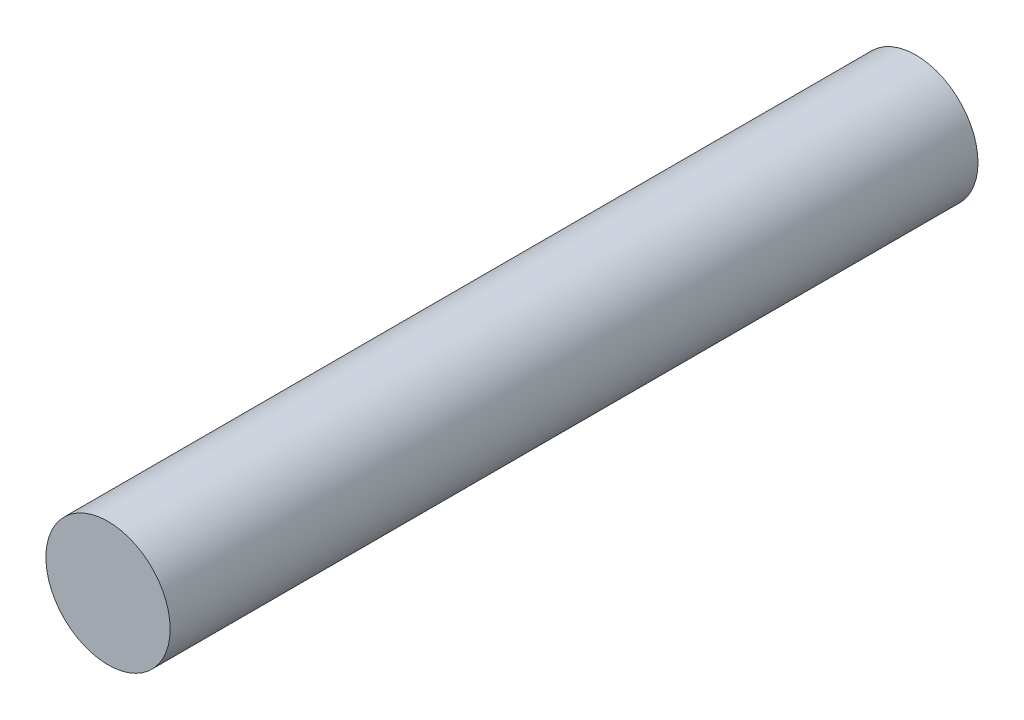
ISO-10303-21;
HEADER;
FILE_DESCRIPTION(('STEP AP214'),'2;1');
FILE_NAME('part.step','',(''),(''),'','','');
FILE_SCHEMA(('AUTOMOTIVE_DESIGN { 1 0 10303 214 1 1 1 1 }'));
ENDSEC;
DATA;
#1=APPLICATION_CONTEXT('core data for automotive mechanical design processes');
#2=APPLICATION_PROTOCOL_DEFINITION('international standard','automotive_design',2000,#1);
#3=PRODUCT_CONTEXT('',#1,'mechanical');
#4=PRODUCT('Part','Part','',(#3));
#5=PRODUCT_RELATED_PRODUCT_CATEGORY('part','',(#4));
#6=PRODUCT_DEFINITION_FORMATION('','',#4);
#7=PRODUCT_DEFINITION_CONTEXT('part definition',#1,'design');
#8=PRODUCT_DEFINITION('design','',#6,#7);
#9=PRODUCT_DEFINITION_SHAPE('','',#8);
#10=(LENGTH_UNIT() NAMED_UNIT(*) SI_UNIT(.MILLI.,.METRE.));
#11=(NAMED_UNIT(*) PLANE_ANGLE_UNIT() SI_UNIT($,.RADIAN.));
#12=(NAMED_UNIT(*) SI_UNIT($,.STERADIAN.) SOLID_ANGLE_UNIT());
#13=UNCERTAINTY_MEASURE_WITH_UNIT(LENGTH_MEASURE(1.E-05),#10,'distance_accuracy_value','');
#14=(GEOMETRIC_REPRESENTATION_CONTEXT(3) GLOBAL_UNCERTAINTY_ASSIGNED_CONTEXT((#13)) GLOBAL_UNIT_ASSIGNED_CONTEXT((#10,
#11,#12)) REPRESENTATION_CONTEXT('',''));
#15=CARTESIAN_POINT('',(0.,0.,0.));
#16=DIRECTION('',(0.,0.,1.));
#17=DIRECTION('',(1.,0.,0.));
#18=AXIS2_PLACEMENT_3D('',#15,#16,#17);
#19=CARTESIAN_POINT('',(0.,0.,65.));
#20=DIRECTION('',(0.,0.,-1.));
#21=DIRECTION('',(-1.,0.,0.));
#22=AXIS2_PLACEMENT_3D('',#19,#20,#21);
#23=CYLINDRICAL_SURFACE('',#22,5.);
#24=CARTESIAN_POINT('',(0.,0.,65.));
#25=DIRECTION('',(0.,0.,1.));
#26=DIRECTION('',(1.,0.,0.));
#27=AXIS2_PLACEMENT_3D('',#24,#25,#26);
#28=CIRCLE('',#27,5.);
#29=CARTESIAN_POINT('',(5.,0.,65.));
#30=VERTEX_POINT('',#29);
#31=EDGE_CURVE('E10',#30,#30,#28,.T.);
#32=ORIENTED_EDGE('',*,*,#31,.F.);
#33=EDGE_LOOP('',(#32));
#34=FACE_BOUND('',#33,.T.);
#35=CARTESIAN_POINT('',(0.,0.,0.));
#36=DIRECTION('',(0.,0.,1.));
#37=DIRECTION('',(1.,0.,0.));
#38=AXIS2_PLACEMENT_3D('',#35,#36,#37);
#39=CIRCLE('',#38,5.);
#40=CARTESIAN_POINT('',(5.,0.,0.));
#41=VERTEX_POINT('',#40);
#42=EDGE_CURVE('E40',#41,#41,#39,.T.);
#43=ORIENTED_EDGE('',*,*,#42,.T.);
#44=EDGE_LOOP('',(#43));
#45=FACE_BOUND('',#44,.T.);
#46=ADVANCED_FACE('F37',(#34,#45),#23,.T.);
#47=CARTESIAN_POINT('',(0.,0.,65.));
#48=DIRECTION('',(0.,0.,1.));
#49=DIRECTION('',(1.,0.,0.));
#50=AXIS2_PLACEMENT_3D('',#47,#48,#49);
#51=PLANE('',#50);
#52=ORIENTED_EDGE('',*,*,#31,.T.);
#53=EDGE_LOOP('',(#52));
#54=FACE_BOUND('',#53,.T.);
#55=ADVANCED_FACE('F54',(#54),#51,.T.);
#56=CARTESIAN_POINT('',(0.,0.,0.));
#57=DIRECTION('',(0.,0.,1.));
#58=DIRECTION('',(1.,0.,0.));
#59=AXIS2_PLACEMENT_3D('',#56,#57,#58);
#60=PLANE('',#59);
#61=ORIENTED_EDGE('',*,*,#42,.F.);
#62=EDGE_LOOP('',(#61));
#63=FACE_BOUND('',#62,.T.);
#64=ADVANCED_FACE('F52',(#63),#60,.F.);
#65=CLOSED_SHELL('',(#46,#55,#64));
#66=MANIFOLD_SOLID_BREP('B2',#65);
#67=ADVANCED_BREP_SHAPE_REPRESENTATION('',(#18,#66),#14);
#68=SHAPE_DEFINITION_REPRESENTATION(#9,#67);
ENDSEC;
END-ISO-10303-21;
